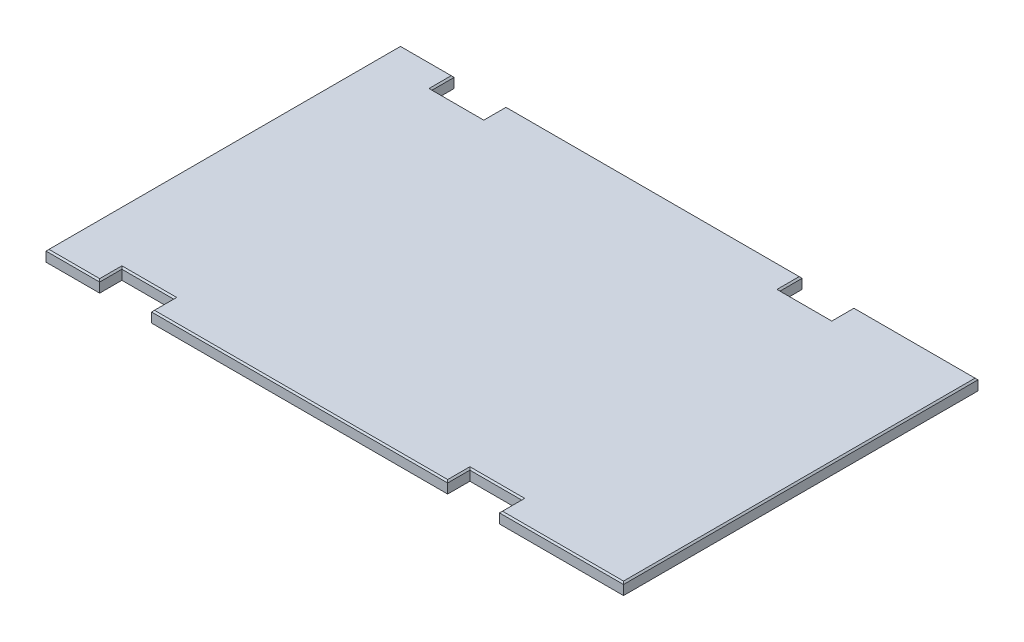
ISO-10303-21;
HEADER;
FILE_DESCRIPTION(('STEP AP214'),'2;1');
FILE_NAME('part.step','',(''),(''),'','','');
FILE_SCHEMA(('AUTOMOTIVE_DESIGN { 1 0 10303 214 1 1 1 1 }'));
ENDSEC;
DATA;
#1=APPLICATION_CONTEXT('core data for automotive mechanical design processes');
#2=APPLICATION_PROTOCOL_DEFINITION('international standard','automotive_design',2000,#1);
#3=PRODUCT_CONTEXT('',#1,'mechanical');
#4=PRODUCT('Part','Part','',(#3));
#5=PRODUCT_RELATED_PRODUCT_CATEGORY('part','',(#4));
#6=PRODUCT_DEFINITION_FORMATION('','',#4);
#7=PRODUCT_DEFINITION_CONTEXT('part definition',#1,'design');
#8=PRODUCT_DEFINITION('design','',#6,#7);
#9=PRODUCT_DEFINITION_SHAPE('','',#8);
#10=(LENGTH_UNIT() NAMED_UNIT(*) SI_UNIT(.MILLI.,.METRE.));
#11=(NAMED_UNIT(*) PLANE_ANGLE_UNIT() SI_UNIT($,.RADIAN.));
#12=(NAMED_UNIT(*) SI_UNIT($,.STERADIAN.) SOLID_ANGLE_UNIT());
#13=UNCERTAINTY_MEASURE_WITH_UNIT(LENGTH_MEASURE(1.E-05),#10,'distance_accuracy_value','');
#14=(GEOMETRIC_REPRESENTATION_CONTEXT(3) GLOBAL_UNCERTAINTY_ASSIGNED_CONTEXT((#13)) GLOBAL_UNIT_ASSIGNED_CONTEXT((#10,
#11,#12)) REPRESENTATION_CONTEXT('',''));
#15=CARTESIAN_POINT('',(0.,0.,0.));
#16=DIRECTION('',(0.,0.,1.));
#17=DIRECTION('',(1.,0.,0.));
#18=AXIS2_PLACEMENT_3D('',#15,#16,#17);
#19=CARTESIAN_POINT('',(0.,19.05,0.));
#20=DIRECTION('',(0.,0.,-1.));
#21=DIRECTION('',(-1.,0.,0.));
#22=AXIS2_PLACEMENT_3D('',#19,#20,#21);
#23=PLANE('',#22);
#24=DIRECTION('',(0.,-1.,0.));
#25=VECTOR('',#24,1.);
#26=CARTESIAN_POINT('',(990.6,19.05,0.));
#27=LINE('',#26,#25);
#28=CARTESIAN_POINT('',(990.6,16.5099999999999,0.));
#29=VERTEX_POINT('',#28);
#30=CARTESIAN_POINT('',(990.6,0.,0.));
#31=VERTEX_POINT('',#30);
#32=EDGE_CURVE('E287',#29,#31,#27,.T.);
#33=ORIENTED_EDGE('',*,*,#32,.F.);
#34=DIRECTION('',(-1.,0.,0.));
#35=VECTOR('',#34,1.);
#36=CARTESIAN_POINT('',(0.,16.5099999999999,0.));
#37=LINE('',#36,#35);
#38=CARTESIAN_POINT('',(777.875,16.5099999999999,0.));
#39=VERTEX_POINT('',#38);
#40=EDGE_CURVE('E66',#29,#39,#37,.T.);
#41=ORIENTED_EDGE('',*,*,#40,.T.);
#42=DIRECTION('',(0.,1.,0.));
#43=VECTOR('',#42,1.);
#44=CARTESIAN_POINT('',(777.875,0.,0.));
#45=LINE('',#44,#43);
#46=CARTESIAN_POINT('',(777.875,0.,0.));
#47=VERTEX_POINT('',#46);
#48=EDGE_CURVE('E433',#47,#39,#45,.T.);
#49=ORIENTED_EDGE('',*,*,#48,.F.);
#50=DIRECTION('',(1.,0.,0.));
#51=VECTOR('',#50,1.);
#52=CARTESIAN_POINT('',(0.,0.,0.));
#53=LINE('',#52,#51);
#54=EDGE_CURVE('E472',#47,#31,#53,.T.);
#55=ORIENTED_EDGE('',*,*,#54,.T.);
#56=EDGE_LOOP('',(#33,#41,#49,#55));
#57=FACE_BOUND('',#56,.T.);
#58=ADVANCED_FACE('F41',(#57),#23,.F.);
#59=DIRECTION('',(0.,1.,0.));
#60=VECTOR('',#59,1.);
#61=CARTESIAN_POINT('',(92.075,0.,0.));
#62=LINE('',#61,#60);
#63=CARTESIAN_POINT('',(92.075,0.,0.));
#64=VERTEX_POINT('',#63);
#65=CARTESIAN_POINT('',(92.075,16.5099999999999,0.));
#66=VERTEX_POINT('',#65);
#67=EDGE_CURVE('E451',#64,#66,#62,.T.);
#68=ORIENTED_EDGE('',*,*,#67,.T.);
#69=DIRECTION('',(-1.,0.,0.));
#70=VECTOR('',#69,1.);
#71=CARTESIAN_POINT('',(0.,16.5099999999999,0.));
#72=LINE('',#71,#70);
#73=CARTESIAN_POINT('',(0.,16.5099999999999,0.));
#74=VERTEX_POINT('',#73);
#75=EDGE_CURVE('E345',#66,#74,#72,.T.);
#76=ORIENTED_EDGE('',*,*,#75,.T.);
#77=DIRECTION('',(0.,-1.,0.));
#78=VECTOR('',#77,1.);
#79=CARTESIAN_POINT('',(0.,19.05,0.));
#80=LINE('',#79,#78);
#81=CARTESIAN_POINT('',(0.,0.,0.));
#82=VERTEX_POINT('',#81);
#83=EDGE_CURVE('E291',#74,#82,#80,.T.);
#84=ORIENTED_EDGE('',*,*,#83,.T.);
#85=EDGE_CURVE('E277',#82,#64,#53,.T.);
#86=ORIENTED_EDGE('',*,*,#85,.T.);
#87=EDGE_LOOP('',(#68,#76,#84,#86));
#88=FACE_BOUND('',#87,.T.);
#89=ADVANCED_FACE('F631',(#88),#23,.F.);
#90=CARTESIAN_POINT('',(0.,19.05,-608.0125));
#91=DIRECTION('',(0.,0.,1.));
#92=DIRECTION('',(1.,0.,0.));
#93=AXIS2_PLACEMENT_3D('',#90,#91,#92);
#94=PLANE('',#93);
#95=DIRECTION('',(0.,-1.,0.));
#96=VECTOR('',#95,1.);
#97=CARTESIAN_POINT('',(0.,19.05,-608.0125));
#98=LINE('',#97,#96);
#99=CARTESIAN_POINT('',(0.,16.5099999999999,-608.0125));
#100=VERTEX_POINT('',#99);
#101=CARTESIAN_POINT('',(0.,0.,-608.0125));
#102=VERTEX_POINT('',#101);
#103=EDGE_CURVE('E281',#100,#102,#98,.T.);
#104=ORIENTED_EDGE('',*,*,#103,.F.);
#105=DIRECTION('',(1.,0.,0.));
#106=VECTOR('',#105,1.);
#107=CARTESIAN_POINT('',(0.,16.5099999999999,-608.0125));
#108=LINE('',#107,#106);
#109=CARTESIAN_POINT('',(92.075,16.5099999999999,-608.0125));
#110=VERTEX_POINT('',#109);
#111=EDGE_CURVE('E262',#100,#110,#108,.T.);
#112=ORIENTED_EDGE('',*,*,#111,.T.);
#113=DIRECTION('',(0.,1.,0.));
#114=VECTOR('',#113,1.);
#115=CARTESIAN_POINT('',(92.075,0.,-608.0125));
#116=LINE('',#115,#114);
#117=CARTESIAN_POINT('',(92.075,0.,-608.0125));
#118=VERTEX_POINT('',#117);
#119=EDGE_CURVE('E244',#118,#110,#116,.T.);
#120=ORIENTED_EDGE('',*,*,#119,.F.);
#121=DIRECTION('',(-1.,0.,0.));
#122=VECTOR('',#121,1.);
#123=CARTESIAN_POINT('',(0.,0.,-608.0125));
#124=LINE('',#123,#122);
#125=EDGE_CURVE('E259',#118,#102,#124,.T.);
#126=ORIENTED_EDGE('',*,*,#125,.T.);
#127=EDGE_LOOP('',(#104,#112,#120,#126));
#128=FACE_BOUND('',#127,.T.);
#129=ADVANCED_FACE('F258',(#128),#94,.F.);
#130=DIRECTION('',(0.,1.,0.));
#131=VECTOR('',#130,1.);
#132=CARTESIAN_POINT('',(777.875,0.,-608.0125));
#133=LINE('',#132,#131);
#134=CARTESIAN_POINT('',(777.875,0.,-608.0125));
#135=VERTEX_POINT('',#134);
#136=CARTESIAN_POINT('',(777.875,16.5099999999999,-608.0125));
#137=VERTEX_POINT('',#136);
#138=EDGE_CURVE('E460',#135,#137,#133,.T.);
#139=ORIENTED_EDGE('',*,*,#138,.T.);
#140=DIRECTION('',(1.,0.,0.));
#141=VECTOR('',#140,1.);
#142=CARTESIAN_POINT('',(0.,16.5099999999999,-608.0125));
#143=LINE('',#142,#141);
#144=CARTESIAN_POINT('',(990.6,16.5099999999999,-608.0125));
#145=VERTEX_POINT('',#144);
#146=EDGE_CURVE('E364',#137,#145,#143,.T.);
#147=ORIENTED_EDGE('',*,*,#146,.T.);
#148=DIRECTION('',(0.,-1.,0.));
#149=VECTOR('',#148,1.);
#150=CARTESIAN_POINT('',(990.6,19.05,-608.0125));
#151=LINE('',#150,#149);
#152=CARTESIAN_POINT('',(990.6,0.,-608.0125));
#153=VERTEX_POINT('',#152);
#154=EDGE_CURVE('E285',#145,#153,#151,.T.);
#155=ORIENTED_EDGE('',*,*,#154,.T.);
#156=EDGE_CURVE('E274',#153,#135,#124,.T.);
#157=ORIENTED_EDGE('',*,*,#156,.T.);
#158=EDGE_LOOP('',(#139,#147,#155,#157));
#159=FACE_BOUND('',#158,.T.);
#160=ADVANCED_FACE('F585',(#159),#94,.F.);
#161=CARTESIAN_POINT('',(0.,19.05,0.));
#162=DIRECTION('',(1.,0.,0.));
#163=DIRECTION('',(0.,0.,-1.));
#164=AXIS2_PLACEMENT_3D('',#161,#162,#163);
#165=PLANE('',#164);
#166=ORIENTED_EDGE('',*,*,#83,.F.);
#167=DIRECTION('',(0.,0.,-1.));
#168=VECTOR('',#167,1.);
#169=CARTESIAN_POINT('',(0.,16.5099999999999,0.));
#170=LINE('',#169,#168);
#171=EDGE_CURVE('E347',#74,#100,#170,.T.);
#172=ORIENTED_EDGE('',*,*,#171,.T.);
#173=ORIENTED_EDGE('',*,*,#103,.T.);
#174=DIRECTION('',(0.,0.,1.));
#175=VECTOR('',#174,1.);
#176=CARTESIAN_POINT('',(0.,0.,0.));
#177=LINE('',#176,#175);
#178=EDGE_CURVE('E270',#102,#82,#177,.T.);
#179=ORIENTED_EDGE('',*,*,#178,.T.);
#180=EDGE_LOOP('',(#166,#172,#173,#179));
#181=FACE_BOUND('',#180,.T.);
#182=ADVANCED_FACE('F633',(#181),#165,.F.);
#183=DIRECTION('',(0.,1.,0.));
#184=VECTOR('',#183,1.);
#185=CARTESIAN_POINT('',(688.975,0.,0.));
#186=LINE('',#185,#184);
#187=CARTESIAN_POINT('',(688.975,0.,0.));
#188=VERTEX_POINT('',#187);
#189=CARTESIAN_POINT('',(688.975,16.5099999999999,0.));
#190=VERTEX_POINT('',#189);
#191=EDGE_CURVE('E438',#188,#190,#186,.T.);
#192=ORIENTED_EDGE('',*,*,#191,.T.);
#193=DIRECTION('',(-1.,0.,0.));
#194=VECTOR('',#193,1.);
#195=CARTESIAN_POINT('',(0.,16.5099999999999,0.));
#196=LINE('',#195,#194);
#197=CARTESIAN_POINT('',(180.975,16.5099999999999,0.));
#198=VERTEX_POINT('',#197);
#199=EDGE_CURVE('E337',#190,#198,#196,.T.);
#200=ORIENTED_EDGE('',*,*,#199,.T.);
#201=DIRECTION('',(0.,1.,0.));
#202=VECTOR('',#201,1.);
#203=CARTESIAN_POINT('',(180.975,0.,0.));
#204=LINE('',#203,#202);
#205=CARTESIAN_POINT('',(180.975,0.,0.));
#206=VERTEX_POINT('',#205);
#207=EDGE_CURVE('E519',#206,#198,#204,.T.);
#208=ORIENTED_EDGE('',*,*,#207,.F.);
#209=EDGE_CURVE('E474',#206,#188,#53,.T.);
#210=ORIENTED_EDGE('',*,*,#209,.T.);
#211=EDGE_LOOP('',(#192,#200,#208,#210));
#212=FACE_BOUND('',#211,.T.);
#213=ADVANCED_FACE('F600',(#212),#23,.F.);
#214=CARTESIAN_POINT('',(990.6,19.05,0.));
#215=DIRECTION('',(-1.,0.,0.));
#216=DIRECTION('',(0.,0.,1.));
#217=AXIS2_PLACEMENT_3D('',#214,#215,#216);
#218=PLANE('',#217);
#219=ORIENTED_EDGE('',*,*,#154,.F.);
#220=DIRECTION('',(0.,0.,1.));
#221=VECTOR('',#220,1.);
#222=CARTESIAN_POINT('',(990.6,16.5099999999999,0.));
#223=LINE('',#222,#221);
#224=EDGE_CURVE('E366',#145,#29,#223,.T.);
#225=ORIENTED_EDGE('',*,*,#224,.T.);
#226=ORIENTED_EDGE('',*,*,#32,.T.);
#227=DIRECTION('',(0.,0.,-1.));
#228=VECTOR('',#227,1.);
#229=CARTESIAN_POINT('',(990.6,0.,0.));
#230=LINE('',#229,#228);
#231=EDGE_CURVE('E272',#31,#153,#230,.T.);
#232=ORIENTED_EDGE('',*,*,#231,.T.);
#233=EDGE_LOOP('',(#219,#225,#226,#232));
#234=FACE_BOUND('',#233,.T.);
#235=ADVANCED_FACE('F484',(#234),#218,.F.);
#236=DIRECTION('',(0.,1.,0.));
#237=VECTOR('',#236,1.);
#238=CARTESIAN_POINT('',(180.975,0.,-608.0125));
#239=LINE('',#238,#237);
#240=CARTESIAN_POINT('',(180.975,0.,-608.0125));
#241=VERTEX_POINT('',#240);
#242=CARTESIAN_POINT('',(180.975,16.5099999999999,-608.0125));
#243=VERTEX_POINT('',#242);
#244=EDGE_CURVE('E263',#241,#243,#239,.T.);
#245=ORIENTED_EDGE('',*,*,#244,.T.);
#246=DIRECTION('',(1.,0.,0.));
#247=VECTOR('',#246,1.);
#248=CARTESIAN_POINT('',(0.,16.5099999999999,-608.0125));
#249=LINE('',#248,#247);
#250=CARTESIAN_POINT('',(688.975,16.5099999999999,-608.0125));
#251=VERTEX_POINT('',#250);
#252=EDGE_CURVE('E356',#243,#251,#249,.T.);
#253=ORIENTED_EDGE('',*,*,#252,.T.);
#254=DIRECTION('',(0.,1.,0.));
#255=VECTOR('',#254,1.);
#256=CARTESIAN_POINT('',(688.975,0.,-608.0125));
#257=LINE('',#256,#255);
#258=CARTESIAN_POINT('',(688.975,0.,-608.0125));
#259=VERTEX_POINT('',#258);
#260=EDGE_CURVE('E467',#259,#251,#257,.T.);
#261=ORIENTED_EDGE('',*,*,#260,.F.);
#262=EDGE_CURVE('E271',#259,#241,#124,.T.);
#263=ORIENTED_EDGE('',*,*,#262,.T.);
#264=EDGE_LOOP('',(#245,#253,#261,#263));
#265=FACE_BOUND('',#264,.T.);
#266=ADVANCED_FACE('F557',(#265),#94,.F.);
#267=CARTESIAN_POINT('',(0.,19.05,0.));
#268=DIRECTION('',(0.,-1.,0.));
#269=DIRECTION('',(0.,0.,-1.));
#270=AXIS2_PLACEMENT_3D('',#267,#268,#269);
#271=PLANE('',#270);
#272=DIRECTION('',(1.,0.,0.));
#273=VECTOR('',#272,1.);
#274=CARTESIAN_POINT('',(0.,19.05,-2.5400000000001));
#275=LINE('',#274,#273);
#276=CARTESIAN_POINT('',(183.515,19.05,-2.5400000000001));
#277=VERTEX_POINT('',#276);
#278=CARTESIAN_POINT('',(686.435,19.05,-2.5400000000001));
#279=VERTEX_POINT('',#278);
#280=EDGE_CURVE('E332',#277,#279,#275,.T.);
#281=ORIENTED_EDGE('',*,*,#280,.T.);
#282=DIRECTION('',(0.,0.,-1.));
#283=VECTOR('',#282,1.);
#284=CARTESIAN_POINT('',(686.435,19.05,0.));
#285=LINE('',#284,#283);
#286=CARTESIAN_POINT('',(686.435,19.05,-40.6400000000009));
#287=VERTEX_POINT('',#286);
#288=EDGE_CURVE('E334',#279,#287,#285,.T.);
#289=ORIENTED_EDGE('',*,*,#288,.T.);
#290=DIRECTION('',(1.,0.,0.));
#291=VECTOR('',#290,1.);
#292=CARTESIAN_POINT('',(0.,19.05,-40.6400000000009));
#293=LINE('',#292,#291);
#294=CARTESIAN_POINT('',(780.415,19.05,-40.6400000000009));
#295=VERTEX_POINT('',#294);
#296=EDGE_CURVE('E296',#287,#295,#293,.T.);
#297=ORIENTED_EDGE('',*,*,#296,.T.);
#298=DIRECTION('',(0.,0.,1.));
#299=VECTOR('',#298,1.);
#300=CARTESIAN_POINT('',(780.415,19.05,0.));
#301=LINE('',#300,#299);
#302=CARTESIAN_POINT('',(780.415,19.05,-2.5400000000001));
#303=VERTEX_POINT('',#302);
#304=EDGE_CURVE('E298',#295,#303,#301,.T.);
#305=ORIENTED_EDGE('',*,*,#304,.T.);
#306=DIRECTION('',(1.,0.,0.));
#307=VECTOR('',#306,1.);
#308=CARTESIAN_POINT('',(0.,19.05,-2.5400000000001));
#309=LINE('',#308,#307);
#310=CARTESIAN_POINT('',(988.06,19.05,-2.5400000000001));
#311=VERTEX_POINT('',#310);
#312=EDGE_CURVE('E300',#303,#311,#309,.T.);
#313=ORIENTED_EDGE('',*,*,#312,.T.);
#314=DIRECTION('',(0.,0.,-1.));
#315=VECTOR('',#314,1.);
#316=CARTESIAN_POINT('',(988.06,19.05,0.));
#317=LINE('',#316,#315);
#318=CARTESIAN_POINT('',(988.06,19.05,-605.4725));
#319=VERTEX_POINT('',#318);
#320=EDGE_CURVE('E302',#311,#319,#317,.T.);
#321=ORIENTED_EDGE('',*,*,#320,.T.);
#322=DIRECTION('',(-1.,0.,0.));
#323=VECTOR('',#322,1.);
#324=CARTESIAN_POINT('',(0.,19.05,-605.4725));
#325=LINE('',#324,#323);
#326=CARTESIAN_POINT('',(780.415,19.05,-605.4725));
#327=VERTEX_POINT('',#326);
#328=EDGE_CURVE('E304',#319,#327,#325,.T.);
#329=ORIENTED_EDGE('',*,*,#328,.T.);
#330=DIRECTION('',(0.,0.,1.));
#331=VECTOR('',#330,1.);
#332=CARTESIAN_POINT('',(780.415,19.05,0.));
#333=LINE('',#332,#331);
#334=CARTESIAN_POINT('',(780.415,19.05,-567.372499999999));
#335=VERTEX_POINT('',#334);
#336=EDGE_CURVE('E306',#327,#335,#333,.T.);
#337=ORIENTED_EDGE('',*,*,#336,.T.);
#338=DIRECTION('',(-1.,0.,0.));
#339=VECTOR('',#338,1.);
#340=CARTESIAN_POINT('',(0.,19.05,-567.372499999999));
#341=LINE('',#340,#339);
#342=CARTESIAN_POINT('',(686.435,19.05,-567.372499999999));
#343=VERTEX_POINT('',#342);
#344=EDGE_CURVE('E308',#335,#343,#341,.T.);
#345=ORIENTED_EDGE('',*,*,#344,.T.);
#346=DIRECTION('',(0.,0.,-1.));
#347=VECTOR('',#346,1.);
#348=CARTESIAN_POINT('',(686.435,19.05,0.));
#349=LINE('',#348,#347);
#350=CARTESIAN_POINT('',(686.435,19.05,-605.4725));
#351=VERTEX_POINT('',#350);
#352=EDGE_CURVE('E310',#343,#351,#349,.T.);
#353=ORIENTED_EDGE('',*,*,#352,.T.);
#354=DIRECTION('',(-1.,0.,0.));
#355=VECTOR('',#354,1.);
#356=CARTESIAN_POINT('',(0.,19.05,-605.4725));
#357=LINE('',#356,#355);
#358=CARTESIAN_POINT('',(183.515,19.05,-605.4725));
#359=VERTEX_POINT('',#358);
#360=EDGE_CURVE('E312',#351,#359,#357,.T.);
#361=ORIENTED_EDGE('',*,*,#360,.T.);
#362=DIRECTION('',(0.,0.,1.));
#363=VECTOR('',#362,1.);
#364=CARTESIAN_POINT('',(183.515,19.05,-1.33689355881944E-13));
#365=LINE('',#364,#363);
#366=CARTESIAN_POINT('',(183.515,19.05,-567.372499999999));
#367=VERTEX_POINT('',#366);
#368=EDGE_CURVE('E314',#359,#367,#365,.T.);
#369=ORIENTED_EDGE('',*,*,#368,.T.);
#370=DIRECTION('',(-1.,0.,0.));
#371=VECTOR('',#370,1.);
#372=CARTESIAN_POINT('',(-7.08560194644699E-13,19.05,-567.372499999999));
#373=LINE('',#372,#371);
#374=CARTESIAN_POINT('',(89.5349999999999,19.05,-567.372499999999));
#375=VERTEX_POINT('',#374);
#376=EDGE_CURVE('E316',#367,#375,#373,.T.);
#377=ORIENTED_EDGE('',*,*,#376,.T.);
#378=DIRECTION('',(0.,0.,-1.));
#379=VECTOR('',#378,1.);
#380=CARTESIAN_POINT('',(89.5349999999999,19.05,0.));
#381=LINE('',#380,#379);
#382=CARTESIAN_POINT('',(89.5349999999999,19.05,-605.4725));
#383=VERTEX_POINT('',#382);
#384=EDGE_CURVE('E318',#375,#383,#381,.T.);
#385=ORIENTED_EDGE('',*,*,#384,.T.);
#386=DIRECTION('',(-1.,0.,0.));
#387=VECTOR('',#386,1.);
#388=CARTESIAN_POINT('',(0.,19.05,-605.4725));
#389=LINE('',#388,#387);
#390=CARTESIAN_POINT('',(2.5400000000001,19.05,-605.4725));
#391=VERTEX_POINT('',#390);
#392=EDGE_CURVE('E320',#383,#391,#389,.T.);
#393=ORIENTED_EDGE('',*,*,#392,.T.);
#394=DIRECTION('',(0.,0.,1.));
#395=VECTOR('',#394,1.);
#396=CARTESIAN_POINT('',(2.5400000000001,19.05,0.));
#397=LINE('',#396,#395);
#398=CARTESIAN_POINT('',(2.5400000000001,19.05,-2.5400000000001));
#399=VERTEX_POINT('',#398);
#400=EDGE_CURVE('E322',#391,#399,#397,.T.);
#401=ORIENTED_EDGE('',*,*,#400,.T.);
#402=DIRECTION('',(1.,0.,0.));
#403=VECTOR('',#402,1.);
#404=CARTESIAN_POINT('',(0.,19.05,-2.5400000000001));
#405=LINE('',#404,#403);
#406=CARTESIAN_POINT('',(89.5349999999999,19.05,-2.5400000000001));
#407=VERTEX_POINT('',#406);
#408=EDGE_CURVE('E324',#399,#407,#405,.T.);
#409=ORIENTED_EDGE('',*,*,#408,.T.);
#410=DIRECTION('',(0.,0.,-1.));
#411=VECTOR('',#410,1.);
#412=CARTESIAN_POINT('',(89.5349999999999,19.05,0.));
#413=LINE('',#412,#411);
#414=CARTESIAN_POINT('',(89.5349999999999,19.05,-40.6400000000009));
#415=VERTEX_POINT('',#414);
#416=EDGE_CURVE('E326',#407,#415,#413,.T.);
#417=ORIENTED_EDGE('',*,*,#416,.T.);
#418=DIRECTION('',(1.,0.,0.));
#419=VECTOR('',#418,1.);
#420=CARTESIAN_POINT('',(0.,19.05,-40.640000000001));
#421=LINE('',#420,#419);
#422=CARTESIAN_POINT('',(183.515,19.05,-40.6400000000008));
#423=VERTEX_POINT('',#422);
#424=EDGE_CURVE('E328',#415,#423,#421,.T.);
#425=ORIENTED_EDGE('',*,*,#424,.T.);
#426=DIRECTION('',(0.,0.,1.));
#427=VECTOR('',#426,1.);
#428=CARTESIAN_POINT('',(183.515,19.05,1.33689355881943E-13));
#429=LINE('',#428,#427);
#430=EDGE_CURVE('E330',#423,#277,#429,.T.);
#431=ORIENTED_EDGE('',*,*,#430,.T.);
#432=EDGE_LOOP('',(#281,#289,#297,#305,#313,#321,#329,#337,#345,#353,#361,#369,#377,#385,#393,
#401,#409,#417,#425,#431));
#433=FACE_BOUND('',#432,.T.);
#434=ADVANCED_FACE('F549',(#433),#271,.F.);
#435=CARTESIAN_POINT('',(0.,0.,0.));
#436=DIRECTION('',(0.,-1.,0.));
#437=DIRECTION('',(0.,0.,-1.));
#438=AXIS2_PLACEMENT_3D('',#435,#436,#437);
#439=PLANE('',#438);
#440=DIRECTION('',(0.,0.,-1.));
#441=VECTOR('',#440,1.);
#442=CARTESIAN_POINT('',(777.875,0.,-38.1000000000008));
#443=LINE('',#442,#441);
#444=CARTESIAN_POINT('',(777.875,0.,-38.1000000000008));
#445=VERTEX_POINT('',#444);
#446=EDGE_CURVE('E442',#47,#445,#443,.T.);
#447=ORIENTED_EDGE('',*,*,#446,.T.);
#448=DIRECTION('',(-1.,0.,0.));
#449=VECTOR('',#448,1.);
#450=CARTESIAN_POINT('',(777.875,0.,-38.1000000000008));
#451=LINE('',#450,#449);
#452=CARTESIAN_POINT('',(688.975,0.,-38.1000000000008));
#453=VERTEX_POINT('',#452);
#454=EDGE_CURVE('E448',#445,#453,#451,.T.);
#455=ORIENTED_EDGE('',*,*,#454,.T.);
#456=DIRECTION('',(0.,0.,1.));
#457=VECTOR('',#456,1.);
#458=CARTESIAN_POINT('',(688.975,0.,-38.1000000000008));
#459=LINE('',#458,#457);
#460=EDGE_CURVE('E444',#453,#188,#459,.T.);
#461=ORIENTED_EDGE('',*,*,#460,.T.);
#462=ORIENTED_EDGE('',*,*,#209,.F.);
#463=DIRECTION('',(0.,0.,-1.));
#464=VECTOR('',#463,1.);
#465=CARTESIAN_POINT('',(180.975,0.,0.));
#466=LINE('',#465,#464);
#467=CARTESIAN_POINT('',(180.975,0.,-38.1000000000007));
#468=VERTEX_POINT('',#467);
#469=EDGE_CURVE('E264',#206,#468,#466,.T.);
#470=ORIENTED_EDGE('',*,*,#469,.T.);
#471=DIRECTION('',(-1.,0.,0.));
#472=VECTOR('',#471,1.);
#473=CARTESIAN_POINT('',(92.075,0.,-38.1000000000008));
#474=LINE('',#473,#472);
#475=CARTESIAN_POINT('',(92.075,0.,-38.1000000000008));
#476=VERTEX_POINT('',#475);
#477=EDGE_CURVE('E513',#468,#476,#474,.T.);
#478=ORIENTED_EDGE('',*,*,#477,.T.);
#479=DIRECTION('',(0.,0.,1.));
#480=VECTOR('',#479,1.);
#481=CARTESIAN_POINT('',(92.075,0.,0.));
#482=LINE('',#481,#480);
#483=EDGE_CURVE('E516',#476,#64,#482,.T.);
#484=ORIENTED_EDGE('',*,*,#483,.T.);
#485=ORIENTED_EDGE('',*,*,#85,.F.);
#486=ORIENTED_EDGE('',*,*,#178,.F.);
#487=ORIENTED_EDGE('',*,*,#125,.F.);
#488=DIRECTION('',(0.,0.,1.));
#489=VECTOR('',#488,1.);
#490=CARTESIAN_POINT('',(92.075,0.,-608.0125));
#491=LINE('',#490,#489);
#492=CARTESIAN_POINT('',(92.075,0.,-569.912499999999));
#493=VERTEX_POINT('',#492);
#494=EDGE_CURVE('E241',#118,#493,#491,.T.);
#495=ORIENTED_EDGE('',*,*,#494,.T.);
#496=DIRECTION('',(1.,0.,0.));
#497=VECTOR('',#496,1.);
#498=CARTESIAN_POINT('',(92.075,0.,-569.912499999999));
#499=LINE('',#498,#497);
#500=CARTESIAN_POINT('',(180.975,0.,-569.912499999999));
#501=VERTEX_POINT('',#500);
#502=EDGE_CURVE('E253',#493,#501,#499,.T.);
#503=ORIENTED_EDGE('',*,*,#502,.T.);
#504=DIRECTION('',(0.,0.,-1.));
#505=VECTOR('',#504,1.);
#506=CARTESIAN_POINT('',(180.975,0.,-608.0125));
#507=LINE('',#506,#505);
#508=EDGE_CURVE('E530',#501,#241,#507,.T.);
#509=ORIENTED_EDGE('',*,*,#508,.T.);
#510=ORIENTED_EDGE('',*,*,#262,.F.);
#511=DIRECTION('',(0.,0.,1.));
#512=VECTOR('',#511,1.);
#513=CARTESIAN_POINT('',(688.975,0.,-569.912499999999));
#514=LINE('',#513,#512);
#515=CARTESIAN_POINT('',(688.975,0.,-569.912499999999));
#516=VERTEX_POINT('',#515);
#517=EDGE_CURVE('E454',#259,#516,#514,.T.);
#518=ORIENTED_EDGE('',*,*,#517,.T.);
#519=DIRECTION('',(1.,0.,0.));
#520=VECTOR('',#519,1.);
#521=CARTESIAN_POINT('',(777.875,0.,-569.912499999999));
#522=LINE('',#521,#520);
#523=CARTESIAN_POINT('',(777.875,0.,-569.912499999999));
#524=VERTEX_POINT('',#523);
#525=EDGE_CURVE('E457',#516,#524,#522,.T.);
#526=ORIENTED_EDGE('',*,*,#525,.T.);
#527=DIRECTION('',(0.,0.,-1.));
#528=VECTOR('',#527,1.);
#529=CARTESIAN_POINT('',(777.875,0.,-569.912499999999));
#530=LINE('',#529,#528);
#531=EDGE_CURVE('E252',#524,#135,#530,.T.);
#532=ORIENTED_EDGE('',*,*,#531,.T.);
#533=ORIENTED_EDGE('',*,*,#156,.F.);
#534=ORIENTED_EDGE('',*,*,#231,.F.);
#535=ORIENTED_EDGE('',*,*,#54,.F.);
#536=EDGE_LOOP('',(#447,#455,#461,#462,#470,#478,#484,#485,#486,#487,#495,#503,#509,#510,#518,
#526,#532,#533,#534,#535));
#537=FACE_BOUND('',#536,.T.);
#538=ADVANCED_FACE('F267',(#537),#439,.T.);
#539=CARTESIAN_POINT('',(777.875,0.,-569.912499999999));
#540=DIRECTION('',(1.,0.,0.));
#541=DIRECTION('',(0.,0.,-1.));
#542=AXIS2_PLACEMENT_3D('',#539,#540,#541);
#543=PLANE('',#542);
#544=DIRECTION('',(0.,1.,0.));
#545=VECTOR('',#544,1.);
#546=CARTESIAN_POINT('',(777.875,0.,-569.912499999999));
#547=LINE('',#546,#545);
#548=CARTESIAN_POINT('',(777.875,16.5099999999999,-569.912499999999));
#549=VERTEX_POINT('',#548);
#550=EDGE_CURVE('E461',#524,#549,#547,.T.);
#551=ORIENTED_EDGE('',*,*,#550,.T.);
#552=DIRECTION('',(0.,0.,-1.));
#553=VECTOR('',#552,1.);
#554=CARTESIAN_POINT('',(777.875,16.5099999999999,-569.912499999999));
#555=LINE('',#554,#553);
#556=EDGE_CURVE('E362',#549,#137,#555,.T.);
#557=ORIENTED_EDGE('',*,*,#556,.T.);
#558=ORIENTED_EDGE('',*,*,#138,.F.);
#559=ORIENTED_EDGE('',*,*,#531,.F.);
#560=EDGE_LOOP('',(#551,#557,#558,#559));
#561=FACE_BOUND('',#560,.T.);
#562=ADVANCED_FACE('F583',(#561),#543,.F.);
#563=CARTESIAN_POINT('',(777.875,0.,-569.912499999999));
#564=DIRECTION('',(0.,0.,1.));
#565=DIRECTION('',(1.,0.,0.));
#566=AXIS2_PLACEMENT_3D('',#563,#564,#565);
#567=PLANE('',#566);
#568=DIRECTION('',(0.,1.,0.));
#569=VECTOR('',#568,1.);
#570=CARTESIAN_POINT('',(688.975,0.,-569.912499999999));
#571=LINE('',#570,#569);
#572=CARTESIAN_POINT('',(688.975,16.5099999999999,-569.912499999999));
#573=VERTEX_POINT('',#572);
#574=EDGE_CURVE('E464',#516,#573,#571,.T.);
#575=ORIENTED_EDGE('',*,*,#574,.T.);
#576=DIRECTION('',(1.,0.,0.));
#577=VECTOR('',#576,1.);
#578=CARTESIAN_POINT('',(777.875,16.5099999999999,-569.912499999999));
#579=LINE('',#578,#577);
#580=EDGE_CURVE('E360',#573,#549,#579,.T.);
#581=ORIENTED_EDGE('',*,*,#580,.T.);
#582=ORIENTED_EDGE('',*,*,#550,.F.);
#583=ORIENTED_EDGE('',*,*,#525,.F.);
#584=EDGE_LOOP('',(#575,#581,#582,#583));
#585=FACE_BOUND('',#584,.T.);
#586=ADVANCED_FACE('F567',(#585),#567,.F.);
#587=CARTESIAN_POINT('',(688.975,0.,-569.912499999999));
#588=DIRECTION('',(-1.,0.,0.));
#589=DIRECTION('',(0.,0.,1.));
#590=AXIS2_PLACEMENT_3D('',#587,#588,#589);
#591=PLANE('',#590);
#592=ORIENTED_EDGE('',*,*,#260,.T.);
#593=DIRECTION('',(0.,0.,1.));
#594=VECTOR('',#593,1.);
#595=CARTESIAN_POINT('',(688.975,16.5099999999999,-569.912499999999));
#596=LINE('',#595,#594);
#597=EDGE_CURVE('E358',#251,#573,#596,.T.);
#598=ORIENTED_EDGE('',*,*,#597,.T.);
#599=ORIENTED_EDGE('',*,*,#574,.F.);
#600=ORIENTED_EDGE('',*,*,#517,.F.);
#601=EDGE_LOOP('',(#592,#598,#599,#600));
#602=FACE_BOUND('',#601,.T.);
#603=ADVANCED_FACE('F562',(#602),#591,.F.);
#604=CARTESIAN_POINT('',(92.075,0.,-608.0125));
#605=DIRECTION('',(-1.,0.,0.));
#606=DIRECTION('',(0.,0.,1.));
#607=AXIS2_PLACEMENT_3D('',#604,#605,#606);
#608=PLANE('',#607);
#609=ORIENTED_EDGE('',*,*,#119,.T.);
#610=DIRECTION('',(0.,0.,1.));
#611=VECTOR('',#610,1.);
#612=CARTESIAN_POINT('',(92.075,16.5099999999999,-608.0125));
#613=LINE('',#612,#611);
#614=CARTESIAN_POINT('',(92.075,16.5099999999999,-569.912499999999));
#615=VERTEX_POINT('',#614);
#616=EDGE_CURVE('E350',#110,#615,#613,.T.);
#617=ORIENTED_EDGE('',*,*,#616,.T.);
#618=DIRECTION('',(0.,1.,0.));
#619=VECTOR('',#618,1.);
#620=CARTESIAN_POINT('',(92.075,0.,-569.912499999999));
#621=LINE('',#620,#619);
#622=EDGE_CURVE('E247',#493,#615,#621,.T.);
#623=ORIENTED_EDGE('',*,*,#622,.F.);
#624=ORIENTED_EDGE('',*,*,#494,.F.);
#625=EDGE_LOOP('',(#609,#617,#623,#624));
#626=FACE_BOUND('',#625,.T.);
#627=ADVANCED_FACE('F243',(#626),#608,.F.);
#628=CARTESIAN_POINT('',(180.975,0.,-608.0125));
#629=DIRECTION('',(1.,0.,0.));
#630=DIRECTION('',(0.,0.,-1.));
#631=AXIS2_PLACEMENT_3D('',#628,#629,#630);
#632=PLANE('',#631);
#633=DIRECTION('',(0.,1.,0.));
#634=VECTOR('',#633,1.);
#635=CARTESIAN_POINT('',(180.975,0.,-569.912499999999));
#636=LINE('',#635,#634);
#637=CARTESIAN_POINT('',(180.975,16.5099999999999,-569.912499999999));
#638=VERTEX_POINT('',#637);
#639=EDGE_CURVE('E535',#501,#638,#636,.T.);
#640=ORIENTED_EDGE('',*,*,#639,.T.);
#641=DIRECTION('',(0.,0.,-1.));
#642=VECTOR('',#641,1.);
#643=CARTESIAN_POINT('',(180.975,16.5099999999999,-608.0125));
#644=LINE('',#643,#642);
#645=EDGE_CURVE('E354',#638,#243,#644,.T.);
#646=ORIENTED_EDGE('',*,*,#645,.T.);
#647=ORIENTED_EDGE('',*,*,#244,.F.);
#648=ORIENTED_EDGE('',*,*,#508,.F.);
#649=EDGE_LOOP('',(#640,#646,#647,#648));
#650=FACE_BOUND('',#649,.T.);
#651=ADVANCED_FACE('F555',(#650),#632,.F.);
#652=CARTESIAN_POINT('',(92.075,0.,-569.912499999999));
#653=DIRECTION('',(0.,0.,1.));
#654=DIRECTION('',(1.,0.,0.));
#655=AXIS2_PLACEMENT_3D('',#652,#653,#654);
#656=PLANE('',#655);
#657=ORIENTED_EDGE('',*,*,#622,.T.);
#658=DIRECTION('',(1.,0.,0.));
#659=VECTOR('',#658,1.);
#660=CARTESIAN_POINT('',(92.075,16.5099999999999,-569.912499999999));
#661=LINE('',#660,#659);
#662=EDGE_CURVE('E352',#615,#638,#661,.T.);
#663=ORIENTED_EDGE('',*,*,#662,.T.);
#664=ORIENTED_EDGE('',*,*,#639,.F.);
#665=ORIENTED_EDGE('',*,*,#502,.F.);
#666=EDGE_LOOP('',(#657,#663,#664,#665));
#667=FACE_BOUND('',#666,.T.);
#668=ADVANCED_FACE('F539',(#667),#656,.F.);
#669=CARTESIAN_POINT('',(92.075,0.,0.));
#670=DIRECTION('',(-1.,0.,0.));
#671=DIRECTION('',(0.,0.,1.));
#672=AXIS2_PLACEMENT_3D('',#669,#670,#671);
#673=PLANE('',#672);
#674=DIRECTION('',(0.,1.,0.));
#675=VECTOR('',#674,1.);
#676=CARTESIAN_POINT('',(92.075,0.,-38.1000000000008));
#677=LINE('',#676,#675);
#678=CARTESIAN_POINT('',(92.075,16.5099999999999,-38.1000000000008));
#679=VERTEX_POINT('',#678);
#680=EDGE_CURVE('E521',#476,#679,#677,.T.);
#681=ORIENTED_EDGE('',*,*,#680,.T.);
#682=DIRECTION('',(0.,0.,1.));
#683=VECTOR('',#682,1.);
#684=CARTESIAN_POINT('',(92.075,16.5099999999999,0.));
#685=LINE('',#684,#683);
#686=EDGE_CURVE('E343',#679,#66,#685,.T.);
#687=ORIENTED_EDGE('',*,*,#686,.T.);
#688=ORIENTED_EDGE('',*,*,#67,.F.);
#689=ORIENTED_EDGE('',*,*,#483,.F.);
#690=EDGE_LOOP('',(#681,#687,#688,#689));
#691=FACE_BOUND('',#690,.T.);
#692=ADVANCED_FACE('F620',(#691),#673,.F.);
#693=CARTESIAN_POINT('',(92.075,0.,-38.1000000000008));
#694=DIRECTION('',(0.,0.,-1.));
#695=DIRECTION('',(-1.,0.,0.));
#696=AXIS2_PLACEMENT_3D('',#693,#694,#695);
#697=PLANE('',#696);
#698=DIRECTION('',(0.,1.,0.));
#699=VECTOR('',#698,1.);
#700=CARTESIAN_POINT('',(180.975,0.,-38.1000000000007));
#701=LINE('',#700,#699);
#702=CARTESIAN_POINT('',(180.975,16.5099999999999,-38.1000000000007));
#703=VERTEX_POINT('',#702);
#704=EDGE_CURVE('E524',#468,#703,#701,.T.);
#705=ORIENTED_EDGE('',*,*,#704,.T.);
#706=DIRECTION('',(-1.,0.,0.));
#707=VECTOR('',#706,1.);
#708=CARTESIAN_POINT('',(92.075,16.5099999999999,-38.1000000000008));
#709=LINE('',#708,#707);
#710=EDGE_CURVE('E341',#703,#679,#709,.T.);
#711=ORIENTED_EDGE('',*,*,#710,.T.);
#712=ORIENTED_EDGE('',*,*,#680,.F.);
#713=ORIENTED_EDGE('',*,*,#477,.F.);
#714=EDGE_LOOP('',(#705,#711,#712,#713));
#715=FACE_BOUND('',#714,.T.);
#716=ADVANCED_FACE('F616',(#715),#697,.F.);
#717=CARTESIAN_POINT('',(180.975,0.,0.));
#718=DIRECTION('',(1.,0.,0.));
#719=DIRECTION('',(0.,0.,-1.));
#720=AXIS2_PLACEMENT_3D('',#717,#718,#719);
#721=PLANE('',#720);
#722=ORIENTED_EDGE('',*,*,#207,.T.);
#723=DIRECTION('',(0.,0.,-1.));
#724=VECTOR('',#723,1.);
#725=CARTESIAN_POINT('',(180.975,16.5099999999999,0.));
#726=LINE('',#725,#724);
#727=EDGE_CURVE('E339',#198,#703,#726,.T.);
#728=ORIENTED_EDGE('',*,*,#727,.T.);
#729=ORIENTED_EDGE('',*,*,#704,.F.);
#730=ORIENTED_EDGE('',*,*,#469,.F.);
#731=EDGE_LOOP('',(#722,#728,#729,#730));
#732=FACE_BOUND('',#731,.T.);
#733=ADVANCED_FACE('F604',(#732),#721,.F.);
#734=CARTESIAN_POINT('',(777.875,0.,-38.1000000000008));
#735=DIRECTION('',(0.,0.,-1.));
#736=DIRECTION('',(-1.,0.,0.));
#737=AXIS2_PLACEMENT_3D('',#734,#735,#736);
#738=PLANE('',#737);
#739=DIRECTION('',(0.,1.,0.));
#740=VECTOR('',#739,1.);
#741=CARTESIAN_POINT('',(777.875,0.,-38.1000000000008));
#742=LINE('',#741,#740);
#743=CARTESIAN_POINT('',(777.875,16.5099999999999,-38.1000000000008));
#744=VERTEX_POINT('',#743);
#745=EDGE_CURVE('E428',#445,#744,#742,.T.);
#746=ORIENTED_EDGE('',*,*,#745,.T.);
#747=DIRECTION('',(-1.,0.,0.));
#748=VECTOR('',#747,1.);
#749=CARTESIAN_POINT('',(777.875,16.5099999999999,-38.1000000000008));
#750=LINE('',#749,#748);
#751=CARTESIAN_POINT('',(688.975,16.5099999999999,-38.1000000000008));
#752=VERTEX_POINT('',#751);
#753=EDGE_CURVE('E11',#744,#752,#750,.T.);
#754=ORIENTED_EDGE('',*,*,#753,.T.);
#755=DIRECTION('',(0.,1.,0.));
#756=VECTOR('',#755,1.);
#757=CARTESIAN_POINT('',(688.975,0.,-38.1000000000008));
#758=LINE('',#757,#756);
#759=EDGE_CURVE('E445',#453,#752,#758,.T.);
#760=ORIENTED_EDGE('',*,*,#759,.F.);
#761=ORIENTED_EDGE('',*,*,#454,.F.);
#762=EDGE_LOOP('',(#746,#754,#760,#761));
#763=FACE_BOUND('',#762,.T.);
#764=ADVANCED_FACE('F504',(#763),#738,.F.);
#765=CARTESIAN_POINT('',(777.875,0.,-38.1000000000008));
#766=DIRECTION('',(1.,0.,0.));
#767=DIRECTION('',(0.,0.,-1.));
#768=AXIS2_PLACEMENT_3D('',#765,#766,#767);
#769=PLANE('',#768);
#770=ORIENTED_EDGE('',*,*,#48,.T.);
#771=DIRECTION('',(0.,0.,-1.));
#772=VECTOR('',#771,1.);
#773=CARTESIAN_POINT('',(777.875,16.5099999999999,-38.1000000000008));
#774=LINE('',#773,#772);
#775=EDGE_CURVE('E51',#39,#744,#774,.T.);
#776=ORIENTED_EDGE('',*,*,#775,.T.);
#777=ORIENTED_EDGE('',*,*,#745,.F.);
#778=ORIENTED_EDGE('',*,*,#446,.F.);
#779=EDGE_LOOP('',(#770,#776,#777,#778));
#780=FACE_BOUND('',#779,.T.);
#781=ADVANCED_FACE('F759',(#780),#769,.F.);
#782=CARTESIAN_POINT('',(688.975,0.,-38.1000000000008));
#783=DIRECTION('',(-1.,0.,0.));
#784=DIRECTION('',(0.,0.,1.));
#785=AXIS2_PLACEMENT_3D('',#782,#783,#784);
#786=PLANE('',#785);
#787=ORIENTED_EDGE('',*,*,#759,.T.);
#788=DIRECTION('',(0.,0.,1.));
#789=VECTOR('',#788,1.);
#790=CARTESIAN_POINT('',(688.975,16.5099999999999,-38.1000000000008));
#791=LINE('',#790,#789);
#792=EDGE_CURVE('E293',#752,#190,#791,.T.);
#793=ORIENTED_EDGE('',*,*,#792,.T.);
#794=ORIENTED_EDGE('',*,*,#191,.F.);
#795=ORIENTED_EDGE('',*,*,#460,.F.);
#796=EDGE_LOOP('',(#787,#793,#794,#795));
#797=FACE_BOUND('',#796,.T.);
#798=ADVANCED_FACE('F507',(#797),#786,.F.);
#799=CARTESIAN_POINT('',(180.975,16.5099999999999,-608.0125));
#800=DIRECTION('',(0.707106781186551,-0.707106781186544,0.));
#801=DIRECTION('',(0.,0.,-1.));
#802=AXIS2_PLACEMENT_3D('',#799,#800,#801);
#803=PLANE('',#802);
#804=DIRECTION('',(0.577350269189631,0.577350269189637,0.57735026918961));
#805=VECTOR('',#804,1.);
#806=CARTESIAN_POINT('',(151.341666666666,-13.1233333333341,-599.545833333332));
#807=LINE('',#806,#805);
#808=EDGE_CURVE('E421',#367,#638,#807,.F.);
#809=ORIENTED_EDGE('',*,*,#808,.F.);
#810=ORIENTED_EDGE('',*,*,#368,.F.);
#811=DIRECTION('',(0.577350269189622,0.577350269189628,0.577350269189628));
#812=VECTOR('',#811,1.);
#813=CARTESIAN_POINT('',(122.343333333334,-42.1216666666664,-666.644166666666));
#814=LINE('',#813,#812);
#815=EDGE_CURVE('E46',#243,#359,#814,.T.);
#816=ORIENTED_EDGE('',*,*,#815,.F.);
#817=ORIENTED_EDGE('',*,*,#645,.F.);
#818=EDGE_LOOP('',(#809,#810,#816,#817));
#819=FACE_BOUND('',#818,.T.);
#820=ADVANCED_FACE('F44',(#819),#803,.F.);
#821=CARTESIAN_POINT('',(0.,19.05,-605.4725));
#822=DIRECTION('',(0.,-0.707106781186548,0.707106781186548));
#823=DIRECTION('',(-1.,0.,0.));
#824=AXIS2_PLACEMENT_3D('',#821,#822,#823);
#825=PLANE('',#824);
#826=ORIENTED_EDGE('',*,*,#815,.T.);
#827=ORIENTED_EDGE('',*,*,#360,.F.);
#828=DIRECTION('',(-0.577350269189626,0.577350269189626,0.577350269189626));
#829=VECTOR('',#828,1.);
#830=CARTESIAN_POINT('',(676.275,29.2100000000002,-595.3125));
#831=LINE('',#830,#829);
#832=EDGE_CURVE('E419',#251,#351,#831,.T.);
#833=ORIENTED_EDGE('',*,*,#832,.F.);
#834=ORIENTED_EDGE('',*,*,#252,.F.);
#835=EDGE_LOOP('',(#826,#827,#833,#834));
#836=FACE_BOUND('',#835,.T.);
#837=ADVANCED_FACE('F748',(#836),#825,.F.);
#838=CARTESIAN_POINT('',(92.075,16.5099999999999,-569.912499999999));
#839=DIRECTION('',(0.,-0.707106781186531,0.707106781186563));
#840=DIRECTION('',(1.,0.,0.));
#841=AXIS2_PLACEMENT_3D('',#838,#839,#840);
#842=PLANE('',#841);
#843=ORIENTED_EDGE('',*,*,#808,.T.);
#844=ORIENTED_EDGE('',*,*,#662,.F.);
#845=DIRECTION('',(-0.577350269189634,0.577350269189634,0.577350269189609));
#846=VECTOR('',#845,1.);
#847=CARTESIAN_POINT('',(104.775,3.80999999999982,-582.612499999999));
#848=LINE('',#847,#846);
#849=EDGE_CURVE('E416',#375,#615,#848,.F.);
#850=ORIENTED_EDGE('',*,*,#849,.F.);
#851=ORIENTED_EDGE('',*,*,#376,.F.);
#852=EDGE_LOOP('',(#843,#844,#850,#851));
#853=FACE_BOUND('',#852,.T.);
#854=ADVANCED_FACE('F542',(#853),#842,.F.);
#855=CARTESIAN_POINT('',(688.975,16.5099999999999,-569.912499999999));
#856=DIRECTION('',(-0.707106781186548,-0.707106781186548,0.));
#857=DIRECTION('',(0.,0.,1.));
#858=AXIS2_PLACEMENT_3D('',#855,#856,#857);
#859=PLANE('',#858);
#860=ORIENTED_EDGE('',*,*,#832,.T.);
#861=ORIENTED_EDGE('',*,*,#352,.F.);
#862=DIRECTION('',(-0.577350269189626,0.577350269189626,0.577350269189626));
#863=VECTOR('',#862,1.);
#864=CARTESIAN_POINT('',(688.975,16.5099999999999,-569.912499999999));
#865=LINE('',#864,#863);
#866=EDGE_CURVE('E413',#573,#343,#865,.T.);
#867=ORIENTED_EDGE('',*,*,#866,.F.);
#868=ORIENTED_EDGE('',*,*,#597,.F.);
#869=EDGE_LOOP('',(#860,#861,#867,#868));
#870=FACE_BOUND('',#869,.T.);
#871=ADVANCED_FACE('F571',(#870),#859,.F.);
#872=CARTESIAN_POINT('',(92.075,16.5099999999999,-608.0125));
#873=DIRECTION('',(-0.707106781186548,-0.707106781186548,0.));
#874=DIRECTION('',(0.,0.,1.));
#875=AXIS2_PLACEMENT_3D('',#872,#873,#874);
#876=PLANE('',#875);
#877=ORIENTED_EDGE('',*,*,#849,.T.);
#878=ORIENTED_EDGE('',*,*,#616,.F.);
#879=DIRECTION('',(-0.577350269189626,0.577350269189626,0.577350269189626));
#880=VECTOR('',#879,1.);
#881=CARTESIAN_POINT('',(92.075,16.5099999999999,-608.0125));
#882=LINE('',#881,#880);
#883=EDGE_CURVE('E410',#383,#110,#882,.F.);
#884=ORIENTED_EDGE('',*,*,#883,.F.);
#885=ORIENTED_EDGE('',*,*,#384,.F.);
#886=EDGE_LOOP('',(#877,#878,#884,#885));
#887=FACE_BOUND('',#886,.T.);
#888=ADVANCED_FACE('F545',(#887),#876,.F.);
#889=CARTESIAN_POINT('',(777.875,16.5099999999999,-569.912499999999));
#890=DIRECTION('',(0.,-0.707106781186548,0.707106781186548));
#891=DIRECTION('',(1.,0.,0.));
#892=AXIS2_PLACEMENT_3D('',#889,#890,#891);
#893=PLANE('',#892);
#894=ORIENTED_EDGE('',*,*,#866,.T.);
#895=ORIENTED_EDGE('',*,*,#344,.F.);
#896=DIRECTION('',(0.577350269189626,0.577350269189626,0.577350269189626));
#897=VECTOR('',#896,1.);
#898=CARTESIAN_POINT('',(777.875,16.5099999999999,-569.912499999999));
#899=LINE('',#898,#897);
#900=EDGE_CURVE('E407',#549,#335,#899,.T.);
#901=ORIENTED_EDGE('',*,*,#900,.F.);
#902=ORIENTED_EDGE('',*,*,#580,.F.);
#903=EDGE_LOOP('',(#894,#895,#901,#902));
#904=FACE_BOUND('',#903,.T.);
#905=ADVANCED_FACE('F575',(#904),#893,.F.);
#906=CARTESIAN_POINT('',(0.,19.05,-605.4725));
#907=DIRECTION('',(0.,-0.707106781186548,0.707106781186548));
#908=DIRECTION('',(-1.,0.,0.));
#909=AXIS2_PLACEMENT_3D('',#906,#907,#908);
#910=PLANE('',#909);
#911=ORIENTED_EDGE('',*,*,#883,.T.);
#912=ORIENTED_EDGE('',*,*,#111,.F.);
#913=DIRECTION('',(0.577350269189626,0.577350269189626,0.577350269189626));
#914=VECTOR('',#913,1.);
#915=CARTESIAN_POINT('',(1.6933333333334,18.2033333333333,-606.319166666667));
#916=LINE('',#915,#914);
#917=EDGE_CURVE('E404',#391,#100,#916,.F.);
#918=ORIENTED_EDGE('',*,*,#917,.F.);
#919=ORIENTED_EDGE('',*,*,#392,.F.);
#920=EDGE_LOOP('',(#911,#912,#918,#919));
#921=FACE_BOUND('',#920,.T.);
#922=ADVANCED_FACE('F638',(#921),#910,.F.);
#923=CARTESIAN_POINT('',(777.875,16.5099999999999,-569.912499999999));
#924=DIRECTION('',(0.707106781186548,-0.707106781186548,0.));
#925=DIRECTION('',(0.,0.,-1.));
#926=AXIS2_PLACEMENT_3D('',#923,#924,#925);
#927=PLANE('',#926);
#928=ORIENTED_EDGE('',*,*,#900,.T.);
#929=ORIENTED_EDGE('',*,*,#336,.F.);
#930=DIRECTION('',(0.577350269189626,0.577350269189626,0.577350269189626));
#931=VECTOR('',#930,1.);
#932=CARTESIAN_POINT('',(520.276666666667,-241.088333333333,-865.610833333333));
#933=LINE('',#932,#931);
#934=EDGE_CURVE('E401',#137,#327,#933,.T.);
#935=ORIENTED_EDGE('',*,*,#934,.F.);
#936=ORIENTED_EDGE('',*,*,#556,.F.);
#937=EDGE_LOOP('',(#928,#929,#935,#936));
#938=FACE_BOUND('',#937,.T.);
#939=ADVANCED_FACE('F580',(#938),#927,.F.);
#940=CARTESIAN_POINT('',(2.5400000000001,19.05,0.));
#941=DIRECTION('',(0.707106781186548,-0.707106781186547,0.));
#942=DIRECTION('',(0.,0.,1.));
#943=AXIS2_PLACEMENT_3D('',#940,#941,#942);
#944=PLANE('',#943);
#945=ORIENTED_EDGE('',*,*,#917,.T.);
#946=ORIENTED_EDGE('',*,*,#171,.F.);
#947=DIRECTION('',(0.577350269189626,0.577350269189626,-0.577350269189626));
#948=VECTOR('',#947,1.);
#949=CARTESIAN_POINT('',(1.6933333333334,18.2033333333333,-1.6933333333334));
#950=LINE('',#949,#948);
#951=EDGE_CURVE('E398',#399,#74,#950,.F.);
#952=ORIENTED_EDGE('',*,*,#951,.F.);
#953=ORIENTED_EDGE('',*,*,#400,.F.);
#954=EDGE_LOOP('',(#945,#946,#952,#953));
#955=FACE_BOUND('',#954,.T.);
#956=ADVANCED_FACE('F635',(#955),#944,.F.);
#957=CARTESIAN_POINT('',(0.,19.05,-605.4725));
#958=DIRECTION('',(0.,-0.707106781186548,0.707106781186548));
#959=DIRECTION('',(-1.,0.,0.));
#960=AXIS2_PLACEMENT_3D('',#957,#958,#959);
#961=PLANE('',#960);
#962=ORIENTED_EDGE('',*,*,#934,.T.);
#963=ORIENTED_EDGE('',*,*,#328,.F.);
#964=DIRECTION('',(-0.577350269189626,0.577350269189626,0.577350269189626));
#965=VECTOR('',#964,1.);
#966=CARTESIAN_POINT('',(786.235833333333,220.874166666667,-403.648333333333));
#967=LINE('',#966,#965);
#968=EDGE_CURVE('E395',#145,#319,#967,.T.);
#969=ORIENTED_EDGE('',*,*,#968,.F.);
#970=ORIENTED_EDGE('',*,*,#146,.F.);
#971=EDGE_LOOP('',(#962,#963,#969,#970));
#972=FACE_BOUND('',#971,.T.);
#973=ADVANCED_FACE('F587',(#972),#961,.F.);
#974=CARTESIAN_POINT('',(0.,19.05,-2.5400000000001));
#975=DIRECTION('',(0.,-0.707106781186547,-0.707106781186548));
#976=DIRECTION('',(1.,0.,0.));
#977=AXIS2_PLACEMENT_3D('',#974,#975,#976);
#978=PLANE('',#977);
#979=ORIENTED_EDGE('',*,*,#951,.T.);
#980=ORIENTED_EDGE('',*,*,#75,.F.);
#981=DIRECTION('',(-0.577350269189626,0.577350269189626,-0.577350269189626));
#982=VECTOR('',#981,1.);
#983=CARTESIAN_POINT('',(59.6899999999999,48.895,-32.3850000000001));
#984=LINE('',#983,#982);
#985=EDGE_CURVE('E392',#407,#66,#984,.F.);
#986=ORIENTED_EDGE('',*,*,#985,.F.);
#987=ORIENTED_EDGE('',*,*,#408,.F.);
#988=EDGE_LOOP('',(#979,#980,#986,#987));
#989=FACE_BOUND('',#988,.T.);
#990=ADVANCED_FACE('F628',(#989),#978,.F.);
#991=CARTESIAN_POINT('',(988.06,19.05,0.));
#992=DIRECTION('',(-0.707106781186548,-0.707106781186548,0.));
#993=DIRECTION('',(0.,0.,-1.));
#994=AXIS2_PLACEMENT_3D('',#991,#992,#993);
#995=PLANE('',#994);
#996=ORIENTED_EDGE('',*,*,#968,.T.);
#997=ORIENTED_EDGE('',*,*,#320,.F.);
#998=DIRECTION('',(-0.577350269189626,0.577350269189626,-0.577350269189626));
#999=VECTOR('',#998,1.);
#1000=CARTESIAN_POINT('',(658.706666666666,348.403333333333,-331.893333333333));
#1001=LINE('',#1000,#999);
#1002=EDGE_CURVE('E389',#29,#311,#1001,.T.);
#1003=ORIENTED_EDGE('',*,*,#1002,.F.);
#1004=ORIENTED_EDGE('',*,*,#224,.F.);
#1005=EDGE_LOOP('',(#996,#997,#1003,#1004));
#1006=FACE_BOUND('',#1005,.T.);
#1007=ADVANCED_FACE('F488',(#1006),#995,.F.);
#1008=CARTESIAN_POINT('',(92.075,16.5099999999999,0.));
#1009=DIRECTION('',(-0.707106781186548,-0.707106781186548,0.));
#1010=DIRECTION('',(0.,0.,1.));
#1011=AXIS2_PLACEMENT_3D('',#1008,#1009,#1010);
#1012=PLANE('',#1011);
#1013=ORIENTED_EDGE('',*,*,#985,.T.);
#1014=ORIENTED_EDGE('',*,*,#686,.F.);
#1015=DIRECTION('',(-0.577350269189625,0.577350269189625,-0.577350269189627));
#1016=VECTOR('',#1015,1.);
#1017=CARTESIAN_POINT('',(92.075,16.5099999999999,-38.1000000000008));
#1018=LINE('',#1017,#1016);
#1019=EDGE_CURVE('E386',#415,#679,#1018,.F.);
#1020=ORIENTED_EDGE('',*,*,#1019,.F.);
#1021=ORIENTED_EDGE('',*,*,#416,.F.);
#1022=EDGE_LOOP('',(#1013,#1014,#1020,#1021));
#1023=FACE_BOUND('',#1022,.T.);
#1024=ADVANCED_FACE('F622',(#1023),#1012,.F.);
#1025=CARTESIAN_POINT('',(0.,19.05,-2.5400000000001));
#1026=DIRECTION('',(0.,-0.707106781186547,-0.707106781186548));
#1027=DIRECTION('',(1.,0.,0.));
#1028=AXIS2_PLACEMENT_3D('',#1025,#1026,#1027);
#1029=PLANE('',#1028);
#1030=ORIENTED_EDGE('',*,*,#1002,.T.);
#1031=ORIENTED_EDGE('',*,*,#312,.F.);
#1032=DIRECTION('',(0.577350269189626,0.577350269189626,-0.577350269189626));
#1033=VECTOR('',#1032,1.);
#1034=CARTESIAN_POINT('',(790.575,29.2100000000002,-12.7000000000003));
#1035=LINE('',#1034,#1033);
#1036=EDGE_CURVE('E383',#39,#303,#1035,.T.);
#1037=ORIENTED_EDGE('',*,*,#1036,.F.);
#1038=ORIENTED_EDGE('',*,*,#40,.F.);
#1039=EDGE_LOOP('',(#1030,#1031,#1037,#1038));
#1040=FACE_BOUND('',#1039,.T.);
#1041=ADVANCED_FACE('F493',(#1040),#1029,.F.);
#1042=CARTESIAN_POINT('',(92.075,16.5099999999999,-38.1000000000008));
#1043=DIRECTION('',(0.,-0.707106781186548,-0.707106781186547));
#1044=DIRECTION('',(-1.,0.,0.));
#1045=AXIS2_PLACEMENT_3D('',#1042,#1043,#1044);
#1046=PLANE('',#1045);
#1047=ORIENTED_EDGE('',*,*,#1019,.T.);
#1048=ORIENTED_EDGE('',*,*,#710,.F.);
#1049=DIRECTION('',(0.577350269189626,0.577350269189626,-0.577350269189626));
#1050=VECTOR('',#1049,1.);
#1051=CARTESIAN_POINT('',(168.274999999999,3.80999999999967,-25.4000000000005));
#1052=LINE('',#1051,#1050);
#1053=EDGE_CURVE('E380',#423,#703,#1052,.F.);
#1054=ORIENTED_EDGE('',*,*,#1053,.F.);
#1055=ORIENTED_EDGE('',*,*,#424,.F.);
#1056=EDGE_LOOP('',(#1047,#1048,#1054,#1055));
#1057=FACE_BOUND('',#1056,.T.);
#1058=ADVANCED_FACE('F613',(#1057),#1046,.F.);
#1059=CARTESIAN_POINT('',(777.875,16.5099999999999,-38.1000000000008));
#1060=DIRECTION('',(0.707106781186548,-0.707106781186548,0.));
#1061=DIRECTION('',(0.,0.,-1.));
#1062=AXIS2_PLACEMENT_3D('',#1059,#1060,#1061);
#1063=PLANE('',#1062);
#1064=ORIENTED_EDGE('',*,*,#1036,.T.);
#1065=ORIENTED_EDGE('',*,*,#304,.F.);
#1066=DIRECTION('',(0.577350269189626,0.577350269189626,-0.577350269189626));
#1067=VECTOR('',#1066,1.);
#1068=CARTESIAN_POINT('',(777.875,16.5099999999999,-38.1000000000008));
#1069=LINE('',#1068,#1067);
#1070=EDGE_CURVE('E377',#744,#295,#1069,.T.);
#1071=ORIENTED_EDGE('',*,*,#1070,.F.);
#1072=ORIENTED_EDGE('',*,*,#775,.F.);
#1073=EDGE_LOOP('',(#1064,#1065,#1071,#1072));
#1074=FACE_BOUND('',#1073,.T.);
#1075=ADVANCED_FACE('F496',(#1074),#1063,.F.);
#1076=CARTESIAN_POINT('',(180.975,16.5099999999999,0.));
#1077=DIRECTION('',(0.707106781186548,-0.707106781186548,0.));
#1078=DIRECTION('',(0.,0.,-1.));
#1079=AXIS2_PLACEMENT_3D('',#1076,#1077,#1078);
#1080=PLANE('',#1079);
#1081=ORIENTED_EDGE('',*,*,#1053,.T.);
#1082=ORIENTED_EDGE('',*,*,#727,.F.);
#1083=DIRECTION('',(0.577350269189626,0.577350269189626,-0.577350269189625));
#1084=VECTOR('',#1083,1.);
#1085=CARTESIAN_POINT('',(180.975,16.5099999999999,0.));
#1086=LINE('',#1085,#1084);
#1087=EDGE_CURVE('E374',#277,#198,#1086,.F.);
#1088=ORIENTED_EDGE('',*,*,#1087,.F.);
#1089=ORIENTED_EDGE('',*,*,#430,.F.);
#1090=EDGE_LOOP('',(#1081,#1082,#1088,#1089));
#1091=FACE_BOUND('',#1090,.T.);
#1092=ADVANCED_FACE('F607',(#1091),#1080,.F.);
#1093=CARTESIAN_POINT('',(777.875,16.5099999999999,-38.1000000000008));
#1094=DIRECTION('',(0.,-0.707106781186548,-0.707106781186548));
#1095=DIRECTION('',(-1.,0.,0.));
#1096=AXIS2_PLACEMENT_3D('',#1093,#1094,#1095);
#1097=PLANE('',#1096);
#1098=ORIENTED_EDGE('',*,*,#1070,.T.);
#1099=ORIENTED_EDGE('',*,*,#296,.F.);
#1100=DIRECTION('',(0.577350269189626,-0.577350269189626,0.577350269189626));
#1101=VECTOR('',#1100,1.);
#1102=CARTESIAN_POINT('',(688.975,16.5099999999999,-38.1000000000008));
#1103=LINE('',#1102,#1101);
#1104=EDGE_CURVE('E372',#752,#287,#1103,.F.);
#1105=ORIENTED_EDGE('',*,*,#1104,.F.);
#1106=ORIENTED_EDGE('',*,*,#753,.F.);
#1107=EDGE_LOOP('',(#1098,#1099,#1105,#1106));
#1108=FACE_BOUND('',#1107,.T.);
#1109=ADVANCED_FACE('F501',(#1108),#1097,.F.);
#1110=CARTESIAN_POINT('',(0.,19.05,-2.5400000000001));
#1111=DIRECTION('',(0.,-0.707106781186547,-0.707106781186548));
#1112=DIRECTION('',(1.,0.,0.));
#1113=AXIS2_PLACEMENT_3D('',#1110,#1111,#1112);
#1114=PLANE('',#1113);
#1115=ORIENTED_EDGE('',*,*,#1087,.T.);
#1116=ORIENTED_EDGE('',*,*,#199,.F.);
#1117=DIRECTION('',(-0.577350269189626,0.577350269189626,-0.577350269189626));
#1118=VECTOR('',#1117,1.);
#1119=CARTESIAN_POINT('',(457.623333333333,247.861666666667,-231.351666666667));
#1120=LINE('',#1119,#1118);
#1121=EDGE_CURVE('E370',#279,#190,#1120,.F.);
#1122=ORIENTED_EDGE('',*,*,#1121,.F.);
#1123=ORIENTED_EDGE('',*,*,#280,.F.);
#1124=EDGE_LOOP('',(#1115,#1116,#1122,#1123));
#1125=FACE_BOUND('',#1124,.T.);
#1126=ADVANCED_FACE('F596',(#1125),#1114,.F.);
#1127=CARTESIAN_POINT('',(688.975,16.5099999999999,-38.1000000000008));
#1128=DIRECTION('',(-0.707106781186548,-0.707106781186548,0.));
#1129=DIRECTION('',(0.,0.,1.));
#1130=AXIS2_PLACEMENT_3D('',#1127,#1128,#1129);
#1131=PLANE('',#1130);
#1132=ORIENTED_EDGE('',*,*,#1104,.T.);
#1133=ORIENTED_EDGE('',*,*,#288,.F.);
#1134=ORIENTED_EDGE('',*,*,#1121,.T.);
#1135=ORIENTED_EDGE('',*,*,#792,.F.);
#1136=EDGE_LOOP('',(#1132,#1133,#1134,#1135));
#1137=FACE_BOUND('',#1136,.T.);
#1138=ADVANCED_FACE('F593',(#1137),#1131,.F.);
#1139=CLOSED_SHELL('',(#58,#89,#129,#160,#182,#213,#235,#266,#434,#538,#562,#586,#603,#627,#651,
#668,#692,#716,#733,#764,#781,#798,#820,#837,#854,#871,#888,#905,#922,#939,#956,#973,#990,#1007,
#1024,#1041,#1058,#1075,#1092,#1109,#1126,#1138));
#1140=MANIFOLD_SOLID_BREP('B2',#1139);
#1141=ADVANCED_BREP_SHAPE_REPRESENTATION('',(#18,#1140),#14);
#1142=SHAPE_DEFINITION_REPRESENTATION(#9,#1141);
ENDSEC;
END-ISO-10303-21;
